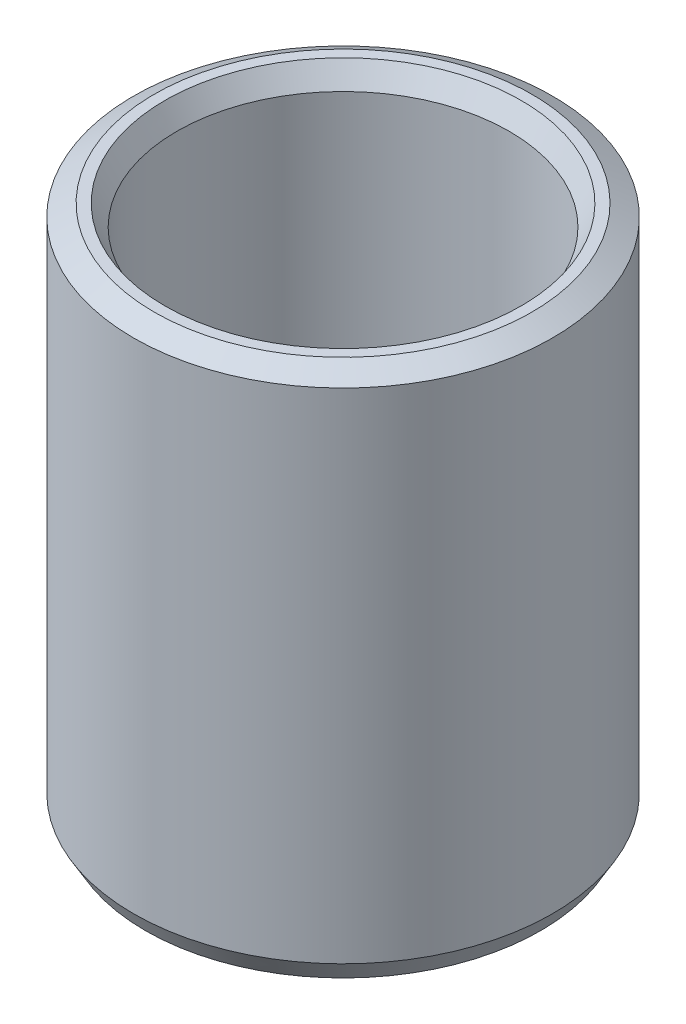
ISO-10303-21;
HEADER;
FILE_DESCRIPTION(('STEP AP214'),'2;1');
FILE_NAME('part.step','',(''),(''),'','','');
FILE_SCHEMA(('AUTOMOTIVE_DESIGN { 1 0 10303 214 1 1 1 1 }'));
ENDSEC;
DATA;
#1=APPLICATION_CONTEXT('core data for automotive mechanical design processes');
#2=APPLICATION_PROTOCOL_DEFINITION('international standard','automotive_design',2000,#1);
#3=PRODUCT_CONTEXT('',#1,'mechanical');
#4=PRODUCT('Part','Part','',(#3));
#5=PRODUCT_RELATED_PRODUCT_CATEGORY('part','',(#4));
#6=PRODUCT_DEFINITION_FORMATION('','',#4);
#7=PRODUCT_DEFINITION_CONTEXT('part definition',#1,'design');
#8=PRODUCT_DEFINITION('design','',#6,#7);
#9=PRODUCT_DEFINITION_SHAPE('','',#8);
#10=(LENGTH_UNIT() NAMED_UNIT(*) SI_UNIT(.MILLI.,.METRE.));
#11=(NAMED_UNIT(*) PLANE_ANGLE_UNIT() SI_UNIT($,.RADIAN.));
#12=(NAMED_UNIT(*) SI_UNIT($,.STERADIAN.) SOLID_ANGLE_UNIT());
#13=UNCERTAINTY_MEASURE_WITH_UNIT(LENGTH_MEASURE(1.E-05),#10,'distance_accuracy_value','');
#14=(GEOMETRIC_REPRESENTATION_CONTEXT(3) GLOBAL_UNCERTAINTY_ASSIGNED_CONTEXT((#13)) GLOBAL_UNIT_ASSIGNED_CONTEXT((#10,
#11,#12)) REPRESENTATION_CONTEXT('',''));
#15=CARTESIAN_POINT('',(0.,0.,0.));
#16=DIRECTION('',(0.,0.,1.));
#17=DIRECTION('',(1.,0.,0.));
#18=AXIS2_PLACEMENT_3D('',#15,#16,#17);
#19=CARTESIAN_POINT('',(0.,152.156167680583,0.));
#20=DIRECTION('',(0.,-1.,0.));
#21=DIRECTION('',(0.,0.,-1.));
#22=AXIS2_PLACEMENT_3D('',#19,#20,#21);
#23=CYLINDRICAL_SURFACE('',#22,60.);
#24=CARTESIAN_POINT('',(0.,5.93613039981084,0.));
#25=DIRECTION('',(0.,1.,0.));
#26=DIRECTION('',(0.,0.,1.));
#27=AXIS2_PLACEMENT_3D('',#24,#25,#26);
#28=CIRCLE('',#27,60.);
#29=CARTESIAN_POINT('',(0.,5.93613039981084,60.));
#30=VERTEX_POINT('',#29);
#31=EDGE_CURVE('E10',#30,#30,#28,.T.);
#32=ORIENTED_EDGE('',*,*,#31,.T.);
#33=EDGE_LOOP('',(#32));
#34=FACE_BOUND('',#33,.T.);
#35=CARTESIAN_POINT('',(0.,148.728941196307,0.));
#36=DIRECTION('',(0.,1.,0.));
#37=DIRECTION('',(0.,0.,1.));
#38=AXIS2_PLACEMENT_3D('',#35,#36,#37);
#39=CIRCLE('',#38,60.);
#40=CARTESIAN_POINT('',(0.,148.728941196307,60.));
#41=VERTEX_POINT('',#40);
#42=EDGE_CURVE('E50',#41,#41,#39,.F.);
#43=ORIENTED_EDGE('',*,*,#42,.T.);
#44=EDGE_LOOP('',(#43));
#45=FACE_BOUND('',#44,.T.);
#46=ADVANCED_FACE('F39',(#34,#45),#23,.T.);
#47=CARTESIAN_POINT('',(0.,152.156167680583,0.));
#48=DIRECTION('',(0.,1.,0.));
#49=DIRECTION('',(0.,0.,1.));
#50=AXIS2_PLACEMENT_3D('',#47,#48,#49);
#51=PLANE('',#50);
#52=CARTESIAN_POINT('',(0.,152.156167680583,0.));
#53=DIRECTION('',(0.,1.,0.));
#54=DIRECTION('',(0.,0.,1.));
#55=AXIS2_PLACEMENT_3D('',#52,#53,#54);
#56=CIRCLE('',#55,50.9988428353228);
#57=CARTESIAN_POINT('',(0.,152.156167680583,50.9988428353228));
#58=VERTEX_POINT('',#57);
#59=EDGE_CURVE('E58',#58,#58,#56,.F.);
#60=ORIENTED_EDGE('',*,*,#59,.T.);
#61=EDGE_LOOP('',(#60));
#62=FACE_BOUND('',#61,.T.);
#63=CARTESIAN_POINT('',(0.,152.156167680583,0.));
#64=DIRECTION('',(0.,1.,0.));
#65=DIRECTION('',(0.,0.,1.));
#66=AXIS2_PLACEMENT_3D('',#63,#64,#65);
#67=CIRCLE('',#66,54.0638696001892);
#68=CARTESIAN_POINT('',(0.,152.156167680583,54.0638696001892));
#69=VERTEX_POINT('',#68);
#70=EDGE_CURVE('E61',#69,#69,#67,.T.);
#71=ORIENTED_EDGE('',*,*,#70,.T.);
#72=EDGE_LOOP('',(#71));
#73=FACE_BOUND('',#72,.T.);
#74=ADVANCED_FACE('F88',(#62,#73),#51,.T.);
#75=CARTESIAN_POINT('',(0.,0.,0.));
#76=DIRECTION('',(0.,1.,0.));
#77=DIRECTION('',(0.,0.,1.));
#78=AXIS2_PLACEMENT_3D('',#75,#76,#77);
#79=PLANE('',#78);
#80=CARTESIAN_POINT('',(0.,0.,0.));
#81=DIRECTION('',(0.,1.,0.));
#82=DIRECTION('',(0.,0.,1.));
#83=AXIS2_PLACEMENT_3D('',#80,#81,#82);
#84=CIRCLE('',#83,53.5077467508581);
#85=CARTESIAN_POINT('',(0.,0.,53.5077467508581));
#86=VERTEX_POINT('',#85);
#87=EDGE_CURVE('E51',#86,#86,#84,.T.);
#88=ORIENTED_EDGE('',*,*,#87,.T.);
#89=EDGE_LOOP('',(#88));
#90=FACE_BOUND('',#89,.T.);
#91=CARTESIAN_POINT('',(0.,0.,0.));
#92=DIRECTION('',(0.,1.,0.));
#93=DIRECTION('',(0.,0.,1.));
#94=AXIS2_PLACEMENT_3D('',#91,#92,#93);
#95=CIRCLE('',#94,56.5727735157245);
#96=CARTESIAN_POINT('',(0.,0.,56.5727735157245));
#97=VERTEX_POINT('',#96);
#98=EDGE_CURVE('E54',#97,#97,#95,.F.);
#99=ORIENTED_EDGE('',*,*,#98,.T.);
#100=EDGE_LOOP('',(#99));
#101=FACE_BOUND('',#100,.T.);
#102=ADVANCED_FACE('F83',(#90,#101),#79,.F.);
#103=CARTESIAN_POINT('',(0.,152.156167680583,0.));
#104=DIRECTION('',(0.,-1.,0.));
#105=DIRECTION('',(0.,0.,-1.));
#106=AXIS2_PLACEMENT_3D('',#103,#104,#105);
#107=CYLINDRICAL_SURFACE('',#106,47.5716163510472);
#108=CARTESIAN_POINT('',(0.,146.220037280772,0.));
#109=DIRECTION('',(0.,1.,0.));
#110=DIRECTION('',(0.,0.,1.));
#111=AXIS2_PLACEMENT_3D('',#108,#109,#110);
#112=CIRCLE('',#111,47.5716163510472);
#113=CARTESIAN_POINT('',(0.,146.220037280772,47.5716163510472));
#114=VERTEX_POINT('',#113);
#115=EDGE_CURVE('E67',#114,#114,#112,.T.);
#116=ORIENTED_EDGE('',*,*,#115,.T.);
#117=EDGE_LOOP('',(#116));
#118=FACE_BOUND('',#117,.T.);
#119=CARTESIAN_POINT('',(0.,3.42722648427554,0.));
#120=DIRECTION('',(0.,1.,0.));
#121=DIRECTION('',(0.,0.,1.));
#122=AXIS2_PLACEMENT_3D('',#119,#120,#121);
#123=CIRCLE('',#122,47.5716163510472);
#124=CARTESIAN_POINT('',(0.,3.42722648427554,47.5716163510472));
#125=VERTEX_POINT('',#124);
#126=EDGE_CURVE('E69',#125,#125,#123,.F.);
#127=ORIENTED_EDGE('',*,*,#126,.T.);
#128=EDGE_LOOP('',(#127));
#129=FACE_BOUND('',#128,.T.);
#130=ADVANCED_FACE('F71',(#118,#129),#107,.F.);
#131=CARTESIAN_POINT('',(0.,146.220037280772,0.));
#132=DIRECTION('',(0.,1.,0.));
#133=DIRECTION('',(0.,0.,1.));
#134=AXIS2_PLACEMENT_3D('',#131,#132,#133);
#135=CONICAL_SURFACE('',#134,47.5716163510472,0.523598775598295);
#136=ORIENTED_EDGE('',*,*,#59,.F.);
#137=EDGE_LOOP('',(#136));
#138=FACE_BOUND('',#137,.T.);
#139=ORIENTED_EDGE('',*,*,#115,.F.);
#140=EDGE_LOOP('',(#139));
#141=FACE_BOUND('',#140,.T.);
#142=ADVANCED_FACE('F77',(#138,#141),#135,.F.);
#143=CARTESIAN_POINT('',(0.,0.,0.));
#144=DIRECTION('',(0.,-1.,0.));
#145=DIRECTION('',(0.,0.,-1.));
#146=AXIS2_PLACEMENT_3D('',#143,#144,#145);
#147=CONICAL_SURFACE('',#146,53.5077467508581,1.04719755119659);
#148=ORIENTED_EDGE('',*,*,#126,.F.);
#149=EDGE_LOOP('',(#148));
#150=FACE_BOUND('',#149,.T.);
#151=ORIENTED_EDGE('',*,*,#87,.F.);
#152=EDGE_LOOP('',(#151));
#153=FACE_BOUND('',#152,.T.);
#154=ADVANCED_FACE('F73',(#150,#153),#147,.F.);
#155=CARTESIAN_POINT('',(0.,5.93613039981084,0.));
#156=DIRECTION('',(0.,1.,0.));
#157=DIRECTION('',(0.,0.,1.));
#158=AXIS2_PLACEMENT_3D('',#155,#156,#157);
#159=CONICAL_SURFACE('',#158,60.,0.523598775598302);
#160=ORIENTED_EDGE('',*,*,#98,.F.);
#161=EDGE_LOOP('',(#160));
#162=FACE_BOUND('',#161,.T.);
#163=ORIENTED_EDGE('',*,*,#31,.F.);
#164=EDGE_LOOP('',(#163));
#165=FACE_BOUND('',#164,.T.);
#166=ADVANCED_FACE('F76',(#162,#165),#159,.T.);
#167=CARTESIAN_POINT('',(0.,152.156167680583,0.));
#168=DIRECTION('',(0.,-1.,0.));
#169=DIRECTION('',(0.,0.,-1.));
#170=AXIS2_PLACEMENT_3D('',#167,#168,#169);
#171=CONICAL_SURFACE('',#170,54.0638696001892,1.04719755119659);
#172=ORIENTED_EDGE('',*,*,#42,.F.);
#173=EDGE_LOOP('',(#172));
#174=FACE_BOUND('',#173,.T.);
#175=ORIENTED_EDGE('',*,*,#70,.F.);
#176=EDGE_LOOP('',(#175));
#177=FACE_BOUND('',#176,.T.);
#178=ADVANCED_FACE('F45',(#174,#177),#171,.T.);
#179=CLOSED_SHELL('',(#46,#74,#102,#130,#142,#154,#166,#178));
#180=MANIFOLD_SOLID_BREP('B2',#179);
#181=ADVANCED_BREP_SHAPE_REPRESENTATION('',(#18,#180),#14);
#182=SHAPE_DEFINITION_REPRESENTATION(#9,#181);
ENDSEC;
END-ISO-10303-21;
